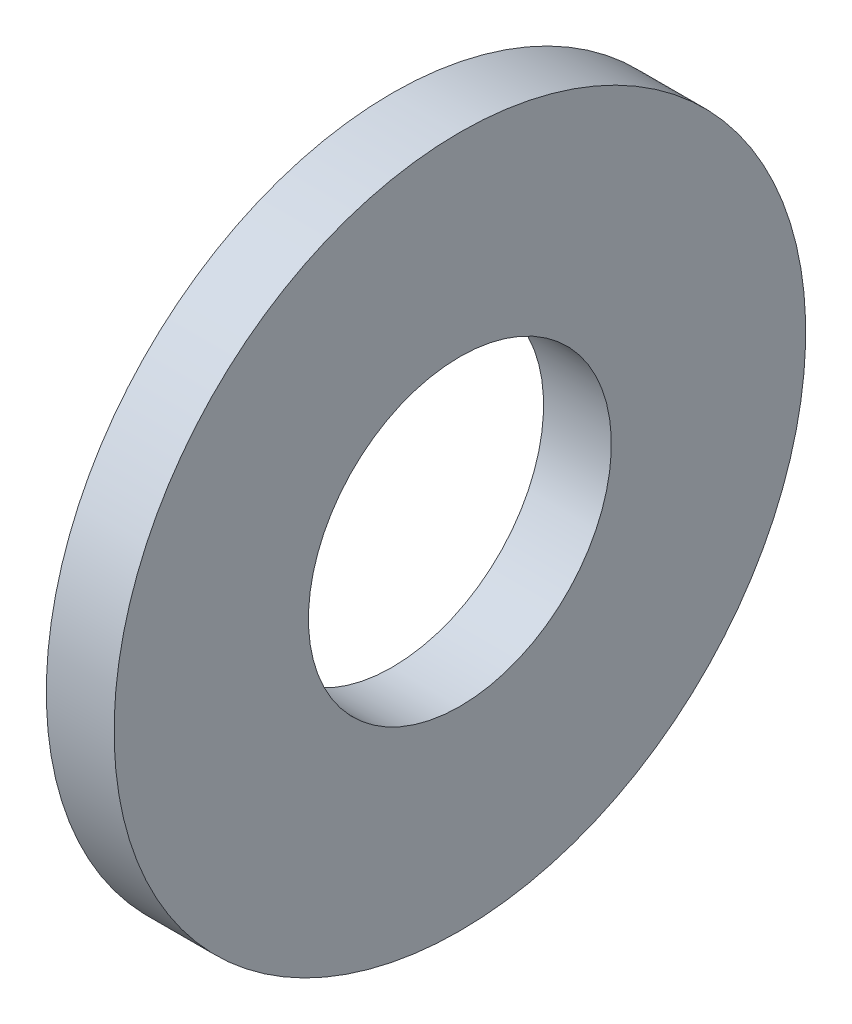
ISO-10303-21;
HEADER;
FILE_DESCRIPTION(('STEP AP214'),'2;1');
FILE_NAME('part.step','',(''),(''),'','','');
FILE_SCHEMA(('AUTOMOTIVE_DESIGN { 1 0 10303 214 1 1 1 1 }'));
ENDSEC;
DATA;
#1=APPLICATION_CONTEXT('core data for automotive mechanical design processes');
#2=APPLICATION_PROTOCOL_DEFINITION('international standard','automotive_design',2000,#1);
#3=PRODUCT_CONTEXT('',#1,'mechanical');
#4=PRODUCT('Part','Part','',(#3));
#5=PRODUCT_RELATED_PRODUCT_CATEGORY('part','',(#4));
#6=PRODUCT_DEFINITION_FORMATION('','',#4);
#7=PRODUCT_DEFINITION_CONTEXT('part definition',#1,'design');
#8=PRODUCT_DEFINITION('design','',#6,#7);
#9=PRODUCT_DEFINITION_SHAPE('','',#8);
#10=(LENGTH_UNIT() NAMED_UNIT(*) SI_UNIT(.MILLI.,.METRE.));
#11=(NAMED_UNIT(*) PLANE_ANGLE_UNIT() SI_UNIT($,.RADIAN.));
#12=(NAMED_UNIT(*) SI_UNIT($,.STERADIAN.) SOLID_ANGLE_UNIT());
#13=UNCERTAINTY_MEASURE_WITH_UNIT(LENGTH_MEASURE(1.E-05),#10,'distance_accuracy_value','');
#14=(GEOMETRIC_REPRESENTATION_CONTEXT(3) GLOBAL_UNCERTAINTY_ASSIGNED_CONTEXT((#13)) GLOBAL_UNIT_ASSIGNED_CONTEXT((#10,
#11,#12)) REPRESENTATION_CONTEXT('',''));
#15=CARTESIAN_POINT('',(0.,0.,0.));
#16=DIRECTION('',(0.,0.,1.));
#17=DIRECTION('',(1.,0.,0.));
#18=AXIS2_PLACEMENT_3D('',#15,#16,#17);
#19=CARTESIAN_POINT('',(0.,2.78129999999999,0.));
#20=DIRECTION('',(-1.,0.,0.));
#21=DIRECTION('',(0.,-1.,0.));
#22=AXIS2_PLACEMENT_3D('',#19,#20,#21);
#23=PLANE('',#22);
#24=CARTESIAN_POINT('',(0.,0.,0.));
#25=DIRECTION('',(-1.,0.,0.));
#26=DIRECTION('',(0.,-1.,0.));
#27=AXIS2_PLACEMENT_3D('',#24,#25,#26);
#28=CIRCLE('',#27,2.7813);
#29=CARTESIAN_POINT('',(0.,-2.78130000000002,0.));
#30=VERTEX_POINT('',#29);
#31=EDGE_CURVE('E18',#30,#30,#28,.T.);
#32=ORIENTED_EDGE('',*,*,#31,.T.);
#33=EDGE_LOOP('',(#32));
#34=FACE_BOUND('',#33,.T.);
#35=CARTESIAN_POINT('',(0.,0.,0.));
#36=DIRECTION('',(-1.,0.,0.));
#37=DIRECTION('',(0.,-1.,0.));
#38=AXIS2_PLACEMENT_3D('',#35,#36,#37);
#39=CIRCLE('',#38,6.35);
#40=CARTESIAN_POINT('',(0.,-6.35000000000002,0.));
#41=VERTEX_POINT('',#40);
#42=EDGE_CURVE('E27',#41,#41,#39,.T.);
#43=ORIENTED_EDGE('',*,*,#42,.F.);
#44=EDGE_LOOP('',(#43));
#45=FACE_BOUND('',#44,.T.);
#46=ADVANCED_FACE('F15',(#34,#45),#23,.F.);
#47=CARTESIAN_POINT('',(-34.9249999999999,0.,0.));
#48=DIRECTION('',(-1.,0.,0.));
#49=DIRECTION('',(0.,-1.,0.));
#50=AXIS2_PLACEMENT_3D('',#47,#48,#49);
#51=CYLINDRICAL_SURFACE('',#50,2.7813);
#52=ORIENTED_EDGE('',*,*,#31,.F.);
#53=EDGE_LOOP('',(#52));
#54=FACE_BOUND('',#53,.T.);
#55=CARTESIAN_POINT('',(-1.24459999999996,0.,0.));
#56=DIRECTION('',(-1.,0.,0.));
#57=DIRECTION('',(0.,-1.,0.));
#58=AXIS2_PLACEMENT_3D('',#55,#56,#57);
#59=CIRCLE('',#58,2.7813);
#60=CARTESIAN_POINT('',(-1.24459999999995,-2.78130000000003,0.));
#61=VERTEX_POINT('',#60);
#62=EDGE_CURVE('E22',#61,#61,#59,.T.);
#63=ORIENTED_EDGE('',*,*,#62,.T.);
#64=EDGE_LOOP('',(#63));
#65=FACE_BOUND('',#64,.T.);
#66=ADVANCED_FACE('F37',(#54,#65),#51,.F.);
#67=CARTESIAN_POINT('',(-34.9249999999999,0.,0.));
#68=DIRECTION('',(-1.,0.,0.));
#69=DIRECTION('',(0.,-1.,0.));
#70=AXIS2_PLACEMENT_3D('',#67,#68,#69);
#71=CYLINDRICAL_SURFACE('',#70,6.35);
#72=CARTESIAN_POINT('',(-1.24459999999996,0.,0.));
#73=DIRECTION('',(-1.,0.,0.));
#74=DIRECTION('',(0.,-1.,0.));
#75=AXIS2_PLACEMENT_3D('',#72,#73,#74);
#76=CIRCLE('',#75,6.35);
#77=CARTESIAN_POINT('',(-1.24459999999996,-6.35000000000003,0.));
#78=VERTEX_POINT('',#77);
#79=EDGE_CURVE('E10',#78,#78,#76,.F.);
#80=ORIENTED_EDGE('',*,*,#79,.T.);
#81=EDGE_LOOP('',(#80));
#82=FACE_BOUND('',#81,.T.);
#83=ORIENTED_EDGE('',*,*,#42,.T.);
#84=EDGE_LOOP('',(#83));
#85=FACE_BOUND('',#84,.T.);
#86=ADVANCED_FACE('F40',(#82,#85),#71,.T.);
#87=CARTESIAN_POINT('',(-1.24459999999993,6.34999999999997,0.));
#88=DIRECTION('',(1.,0.,0.));
#89=DIRECTION('',(0.,1.,0.));
#90=AXIS2_PLACEMENT_3D('',#87,#88,#89);
#91=PLANE('',#90);
#92=ORIENTED_EDGE('',*,*,#79,.F.);
#93=EDGE_LOOP('',(#92));
#94=FACE_BOUND('',#93,.T.);
#95=ORIENTED_EDGE('',*,*,#62,.F.);
#96=EDGE_LOOP('',(#95));
#97=FACE_BOUND('',#96,.T.);
#98=ADVANCED_FACE('F43',(#94,#97),#91,.F.);
#99=CLOSED_SHELL('',(#46,#66,#86,#98));
#100=MANIFOLD_SOLID_BREP('B1',#99);
#101=ADVANCED_BREP_SHAPE_REPRESENTATION('',(#18,#100),#14);
#102=SHAPE_DEFINITION_REPRESENTATION(#9,#101);
ENDSEC;
END-ISO-10303-21;
